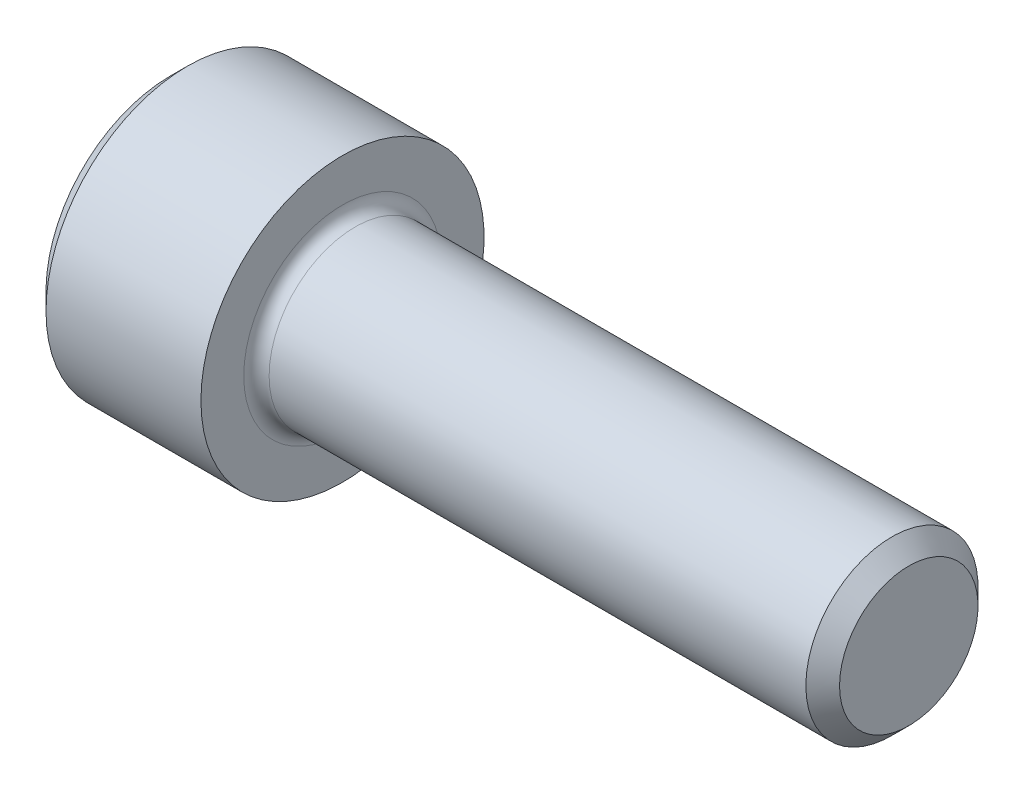
ISO-10303-21;
HEADER;
FILE_DESCRIPTION(('STEP AP214'),'2;1');
FILE_NAME('part.step','',(''),(''),'','','');
FILE_SCHEMA(('AUTOMOTIVE_DESIGN { 1 0 10303 214 1 1 1 1 }'));
ENDSEC;
DATA;
#1=APPLICATION_CONTEXT('core data for automotive mechanical design processes');
#2=APPLICATION_PROTOCOL_DEFINITION('international standard','automotive_design',2000,#1);
#3=PRODUCT_CONTEXT('',#1,'mechanical');
#4=PRODUCT('Part','Part','',(#3));
#5=PRODUCT_RELATED_PRODUCT_CATEGORY('part','',(#4));
#6=PRODUCT_DEFINITION_FORMATION('','',#4);
#7=PRODUCT_DEFINITION_CONTEXT('part definition',#1,'design');
#8=PRODUCT_DEFINITION('design','',#6,#7);
#9=PRODUCT_DEFINITION_SHAPE('','',#8);
#10=(LENGTH_UNIT() NAMED_UNIT(*) SI_UNIT(.MILLI.,.METRE.));
#11=(NAMED_UNIT(*) PLANE_ANGLE_UNIT() SI_UNIT($,.RADIAN.));
#12=(NAMED_UNIT(*) SI_UNIT($,.STERADIAN.) SOLID_ANGLE_UNIT());
#13=UNCERTAINTY_MEASURE_WITH_UNIT(LENGTH_MEASURE(1.E-05),#10,'distance_accuracy_value','');
#14=(GEOMETRIC_REPRESENTATION_CONTEXT(3) GLOBAL_UNCERTAINTY_ASSIGNED_CONTEXT((#13)) GLOBAL_UNIT_ASSIGNED_CONTEXT((#10,
#11,#12)) REPRESENTATION_CONTEXT('',''));
#15=CARTESIAN_POINT('',(0.,0.,0.));
#16=DIRECTION('',(0.,0.,1.));
#17=DIRECTION('',(1.,0.,0.));
#18=AXIS2_PLACEMENT_3D('',#15,#16,#17);
#19=CARTESIAN_POINT('',(2.286,1.14604605784411,1.98501));
#20=DIRECTION('',(-1.,0.,0.));
#21=DIRECTION('',(0.,0.,1.));
#22=AXIS2_PLACEMENT_3D('',#19,#20,#21);
#23=PLANE('',#22);
#24=DIRECTION('',(0.,0.500000000000001,0.866025403784438));
#25=VECTOR('',#24,1.);
#26=CARTESIAN_POINT('',(2.286,-1.71906908676614,0.992505));
#27=LINE('',#26,#25);
#28=CARTESIAN_POINT('',(2.2859999999804,-1.71906908679011,0.992505000013839));
#29=VERTEX_POINT('',#28);
#30=CARTESIAN_POINT('',(2.286,-1.14604605784409,1.98501));
#31=VERTEX_POINT('',#30);
#32=EDGE_CURVE('E100',#29,#31,#27,.T.);
#33=ORIENTED_EDGE('',*,*,#32,.T.);
#34=DIRECTION('',(0.,1.,0.));
#35=VECTOR('',#34,1.);
#36=CARTESIAN_POINT('',(2.286,1.14604605784411,1.98501));
#37=LINE('',#36,#35);
#38=CARTESIAN_POINT('',(2.28599999998701,0.,1.98501000001309));
#39=VERTEX_POINT('',#38);
#40=EDGE_CURVE('E95',#31,#39,#37,.T.);
#41=ORIENTED_EDGE('',*,*,#40,.T.);
#42=CARTESIAN_POINT('',(2.2859999999608,0.,0.));
#43=DIRECTION('',(-1.,0.,0.));
#44=DIRECTION('',(0.,0.,1.));
#45=AXIS2_PLACEMENT_3D('',#42,#43,#44);
#46=CIRCLE('',#45,1.98501000005535);
#47=EDGE_CURVE('E97',#39,#29,#46,.F.);
#48=ORIENTED_EDGE('',*,*,#47,.T.);
#49=EDGE_LOOP('',(#33,#41,#48));
#50=FACE_BOUND('',#49,.T.);
#51=ADVANCED_FACE('F16',(#50),#23,.T.);
#52=CARTESIAN_POINT('',(2.286,1.14604605784411,1.98501));
#53=DIRECTION('',(-1.,0.,0.));
#54=DIRECTION('',(0.,0.,1.));
#55=AXIS2_PLACEMENT_3D('',#52,#53,#54);
#56=PLANE('',#55);
#57=DIRECTION('',(0.,-0.499999999999998,0.86602540378444));
#58=VECTOR('',#57,1.);
#59=CARTESIAN_POINT('',(2.286,-1.71906908676615,-0.992504999999996));
#60=LINE('',#59,#58);
#61=CARTESIAN_POINT('',(2.2859999999804,-1.71906908679012,-0.992505000013836));
#62=VERTEX_POINT('',#61);
#63=CARTESIAN_POINT('',(2.286,-2.29209211568819,0.));
#64=VERTEX_POINT('',#63);
#65=EDGE_CURVE('E104',#62,#64,#60,.T.);
#66=ORIENTED_EDGE('',*,*,#65,.T.);
#67=DIRECTION('',(0.,0.500000000000001,0.866025403784438));
#68=VECTOR('',#67,1.);
#69=CARTESIAN_POINT('',(2.286,-2.29209211568819,0.));
#70=LINE('',#69,#68);
#71=EDGE_CURVE('E171',#64,#29,#70,.T.);
#72=ORIENTED_EDGE('',*,*,#71,.T.);
#73=CARTESIAN_POINT('',(2.2859999999608,0.,0.));
#74=DIRECTION('',(-1.,0.,0.));
#75=DIRECTION('',(0.,0.,1.));
#76=AXIS2_PLACEMENT_3D('',#73,#74,#75);
#77=CIRCLE('',#76,1.98501000005535);
#78=EDGE_CURVE('E116',#29,#62,#77,.F.);
#79=ORIENTED_EDGE('',*,*,#78,.T.);
#80=EDGE_LOOP('',(#66,#72,#79));
#81=FACE_BOUND('',#80,.T.);
#82=ADVANCED_FACE('F347',(#81),#56,.T.);
#83=CARTESIAN_POINT('',(2.286,1.14604605784411,1.98501));
#84=DIRECTION('',(-1.,0.,0.));
#85=DIRECTION('',(0.,0.,1.));
#86=AXIS2_PLACEMENT_3D('',#83,#84,#85);
#87=PLANE('',#86);
#88=DIRECTION('',(0.,1.,0.));
#89=VECTOR('',#88,1.);
#90=CARTESIAN_POINT('',(2.286,1.14604605784411,-1.98501));
#91=LINE('',#90,#89);
#92=CARTESIAN_POINT('',(2.28599999998701,0.,-1.98501000001309));
#93=VERTEX_POINT('',#92);
#94=CARTESIAN_POINT('',(2.286,-1.1460460578441,-1.98501));
#95=VERTEX_POINT('',#94);
#96=EDGE_CURVE('E166',#93,#95,#91,.F.);
#97=ORIENTED_EDGE('',*,*,#96,.T.);
#98=DIRECTION('',(0.,-0.499999999999999,0.866025403784439));
#99=VECTOR('',#98,1.);
#100=CARTESIAN_POINT('',(2.286,-1.1460460578441,-1.98501));
#101=LINE('',#100,#99);
#102=EDGE_CURVE('E161',#95,#62,#101,.T.);
#103=ORIENTED_EDGE('',*,*,#102,.T.);
#104=CARTESIAN_POINT('',(2.2859999999608,0.,0.));
#105=DIRECTION('',(-1.,0.,0.));
#106=DIRECTION('',(0.,0.,1.));
#107=AXIS2_PLACEMENT_3D('',#104,#105,#106);
#108=CIRCLE('',#107,1.98501000005535);
#109=EDGE_CURVE('E224',#62,#93,#108,.F.);
#110=ORIENTED_EDGE('',*,*,#109,.T.);
#111=EDGE_LOOP('',(#97,#103,#110));
#112=FACE_BOUND('',#111,.T.);
#113=ADVANCED_FACE('F344',(#112),#87,.T.);
#114=CARTESIAN_POINT('',(2.286,1.14604605784411,1.98501));
#115=DIRECTION('',(-1.,0.,0.));
#116=DIRECTION('',(0.,0.,1.));
#117=AXIS2_PLACEMENT_3D('',#114,#115,#116);
#118=PLANE('',#117);
#119=DIRECTION('',(0.,-0.500000000000001,-0.866025403784438));
#120=VECTOR('',#119,1.);
#121=CARTESIAN_POINT('',(2.286,1.71906908676615,-0.992505000000006));
#122=LINE('',#121,#120);
#123=CARTESIAN_POINT('',(2.2859999999804,1.71906908679012,-0.992505000013843));
#124=VERTEX_POINT('',#123);
#125=CARTESIAN_POINT('',(2.286,1.1460460578441,-1.98501));
#126=VERTEX_POINT('',#125);
#127=EDGE_CURVE('E156',#124,#126,#122,.T.);
#128=ORIENTED_EDGE('',*,*,#127,.T.);
#129=DIRECTION('',(0.,1.,0.));
#130=VECTOR('',#129,1.);
#131=CARTESIAN_POINT('',(2.286,1.14604605784411,-1.98501));
#132=LINE('',#131,#130);
#133=EDGE_CURVE('E151',#126,#93,#132,.F.);
#134=ORIENTED_EDGE('',*,*,#133,.T.);
#135=CARTESIAN_POINT('',(2.2859999999608,0.,0.));
#136=DIRECTION('',(-1.,0.,0.));
#137=DIRECTION('',(0.,0.,1.));
#138=AXIS2_PLACEMENT_3D('',#135,#136,#137);
#139=CIRCLE('',#138,1.98501000005535);
#140=EDGE_CURVE('E221',#93,#124,#139,.F.);
#141=ORIENTED_EDGE('',*,*,#140,.T.);
#142=EDGE_LOOP('',(#128,#134,#141));
#143=FACE_BOUND('',#142,.T.);
#144=ADVANCED_FACE('F340',(#143),#118,.T.);
#145=CARTESIAN_POINT('',(2.286,1.14604605784411,1.98501));
#146=DIRECTION('',(-1.,0.,0.));
#147=DIRECTION('',(0.,0.,1.));
#148=AXIS2_PLACEMENT_3D('',#145,#146,#147);
#149=PLANE('',#148);
#150=DIRECTION('',(0.,0.500000000000002,-0.866025403784437));
#151=VECTOR('',#150,1.);
#152=CARTESIAN_POINT('',(2.286,1.71906908676615,0.992504999999996));
#153=LINE('',#152,#151);
#154=CARTESIAN_POINT('',(2.2859999999804,1.71906908679012,0.992505000013835));
#155=VERTEX_POINT('',#154);
#156=CARTESIAN_POINT('',(2.286,2.2920921156882,0.));
#157=VERTEX_POINT('',#156);
#158=EDGE_CURVE('E146',#155,#157,#153,.T.);
#159=ORIENTED_EDGE('',*,*,#158,.T.);
#160=DIRECTION('',(0.,-0.500000000000002,-0.866025403784437));
#161=VECTOR('',#160,1.);
#162=CARTESIAN_POINT('',(2.286,2.2920921156882,0.));
#163=LINE('',#162,#161);
#164=EDGE_CURVE('E117',#157,#124,#163,.T.);
#165=ORIENTED_EDGE('',*,*,#164,.T.);
#166=CARTESIAN_POINT('',(2.2859999999608,0.,0.));
#167=DIRECTION('',(-1.,0.,0.));
#168=DIRECTION('',(0.,0.,1.));
#169=AXIS2_PLACEMENT_3D('',#166,#167,#168);
#170=CIRCLE('',#169,1.98501000005535);
#171=EDGE_CURVE('E124',#124,#155,#170,.F.);
#172=ORIENTED_EDGE('',*,*,#171,.T.);
#173=EDGE_LOOP('',(#159,#165,#172));
#174=FACE_BOUND('',#173,.T.);
#175=ADVANCED_FACE('F336',(#174),#149,.T.);
#176=CARTESIAN_POINT('',(2.28600000002643,0.,0.));
#177=DIRECTION('',(-1.,0.,0.));
#178=DIRECTION('',(0.,0.,1.));
#179=AXIS2_PLACEMENT_3D('',#176,#177,#178);
#180=CONICAL_SURFACE('',#179,1.98500999994167,1.04719755112655);
#181=CARTESIAN_POINT('',(3.43204605781011,0.,5.6843418860808E-11));
#182=VERTEX_POINT('',#181);
#183=VERTEX_LOOP('',#182);
#184=FACE_BOUND('',#183,.T.);
#185=ORIENTED_EDGE('',*,*,#47,.F.);
#186=CARTESIAN_POINT('',(2.2859999999608,0.,0.));
#187=DIRECTION('',(-1.,0.,0.));
#188=DIRECTION('',(0.,0.,1.));
#189=AXIS2_PLACEMENT_3D('',#186,#187,#188);
#190=CIRCLE('',#189,1.98501000005535);
#191=EDGE_CURVE('E112',#155,#39,#190,.F.);
#192=ORIENTED_EDGE('',*,*,#191,.F.);
#193=ORIENTED_EDGE('',*,*,#171,.F.);
#194=ORIENTED_EDGE('',*,*,#140,.F.);
#195=ORIENTED_EDGE('',*,*,#109,.F.);
#196=ORIENTED_EDGE('',*,*,#78,.F.);
#197=EDGE_LOOP('',(#185,#192,#193,#194,#195,#196));
#198=FACE_BOUND('',#197,.T.);
#199=ADVANCED_FACE('F110',(#184,#198),#180,.F.);
#200=CARTESIAN_POINT('',(2.286,1.14604605784411,1.98501));
#201=DIRECTION('',(-1.,0.,0.));
#202=DIRECTION('',(0.,0.,1.));
#203=AXIS2_PLACEMENT_3D('',#200,#201,#202);
#204=PLANE('',#203);
#205=DIRECTION('',(0.,-1.,0.));
#206=VECTOR('',#205,1.);
#207=CARTESIAN_POINT('',(2.286,-1.14604605784409,1.98501));
#208=LINE('',#207,#206);
#209=CARTESIAN_POINT('',(2.286,1.14604605784411,1.98501));
#210=VERTEX_POINT('',#209);
#211=EDGE_CURVE('E121',#39,#210,#208,.F.);
#212=ORIENTED_EDGE('',*,*,#211,.T.);
#213=DIRECTION('',(0.,0.499999999999998,-0.86602540378444));
#214=VECTOR('',#213,1.);
#215=CARTESIAN_POINT('',(2.286,2.2920921156882,0.));
#216=LINE('',#215,#214);
#217=EDGE_CURVE('E123',#155,#210,#216,.F.);
#218=ORIENTED_EDGE('',*,*,#217,.F.);
#219=ORIENTED_EDGE('',*,*,#191,.T.);
#220=EDGE_LOOP('',(#212,#218,#219));
#221=FACE_BOUND('',#220,.T.);
#222=ADVANCED_FACE('F120',(#221),#204,.T.);
#223=CARTESIAN_POINT('',(2.286,2.2920921156882,0.));
#224=DIRECTION('',(0.,-0.86602540378444,-0.499999999999998));
#225=DIRECTION('',(0.,0.499999999999998,-0.86602540378444));
#226=AXIS2_PLACEMENT_3D('',#223,#224,#225);
#227=PLANE('',#226);
#228=ORIENTED_EDGE('',*,*,#217,.T.);
#229=DIRECTION('',(1.,0.,0.));
#230=VECTOR('',#229,1.);
#231=CARTESIAN_POINT('',(2.286,1.14604605784411,1.98501));
#232=LINE('',#231,#230);
#233=CARTESIAN_POINT('',(0.,1.14604605784411,1.98501));
#234=VERTEX_POINT('',#233);
#235=EDGE_CURVE('E129',#210,#234,#232,.F.);
#236=ORIENTED_EDGE('',*,*,#235,.T.);
#237=DIRECTION('',(0.,-0.499999999999998,0.86602540378444));
#238=VECTOR('',#237,1.);
#239=CARTESIAN_POINT('',(0.,2.2920921156882,0.));
#240=LINE('',#239,#238);
#241=CARTESIAN_POINT('',(0.,2.2920921156882,0.));
#242=VERTEX_POINT('',#241);
#243=EDGE_CURVE('E136',#242,#234,#240,.T.);
#244=ORIENTED_EDGE('',*,*,#243,.F.);
#245=DIRECTION('',(1.,0.,0.));
#246=VECTOR('',#245,1.);
#247=CARTESIAN_POINT('',(2.286,2.2920921156882,0.));
#248=LINE('',#247,#246);
#249=EDGE_CURVE('E186',#242,#157,#248,.T.);
#250=ORIENTED_EDGE('',*,*,#249,.T.);
#251=ORIENTED_EDGE('',*,*,#158,.F.);
#252=EDGE_LOOP('',(#228,#236,#244,#250,#251));
#253=FACE_BOUND('',#252,.T.);
#254=ADVANCED_FACE('F328',(#253),#227,.T.);
#255=CARTESIAN_POINT('',(2.286,-1.14604605784409,1.98501));
#256=DIRECTION('',(0.,0.,1.));
#257=DIRECTION('',(0.,-1.,0.));
#258=AXIS2_PLACEMENT_3D('',#255,#256,#257);
#259=PLANE('',#258);
#260=ORIENTED_EDGE('',*,*,#235,.F.);
#261=ORIENTED_EDGE('',*,*,#211,.F.);
#262=ORIENTED_EDGE('',*,*,#40,.F.);
#263=DIRECTION('',(1.,0.,0.));
#264=VECTOR('',#263,1.);
#265=CARTESIAN_POINT('',(2.286,-1.14604605784409,1.98501));
#266=LINE('',#265,#264);
#267=CARTESIAN_POINT('',(0.,-1.14604605784409,1.98501));
#268=VERTEX_POINT('',#267);
#269=EDGE_CURVE('E131',#268,#31,#266,.T.);
#270=ORIENTED_EDGE('',*,*,#269,.F.);
#271=DIRECTION('',(0.,1.,0.));
#272=VECTOR('',#271,1.);
#273=CARTESIAN_POINT('',(0.,0.,1.98501));
#274=LINE('',#273,#272);
#275=EDGE_CURVE('E362',#234,#268,#274,.F.);
#276=ORIENTED_EDGE('',*,*,#275,.F.);
#277=EDGE_LOOP('',(#260,#261,#262,#270,#276));
#278=FACE_BOUND('',#277,.T.);
#279=ADVANCED_FACE('F127',(#278),#259,.F.);
#280=CARTESIAN_POINT('',(2.286,-1.14604605784409,1.98501));
#281=DIRECTION('',(0.,0.866025403784438,-0.500000000000001));
#282=DIRECTION('',(0.,0.500000000000001,0.866025403784438));
#283=AXIS2_PLACEMENT_3D('',#280,#281,#282);
#284=PLANE('',#283);
#285=ORIENTED_EDGE('',*,*,#71,.F.);
#286=DIRECTION('',(1.,0.,0.));
#287=VECTOR('',#286,1.);
#288=CARTESIAN_POINT('',(2.286,-2.29209211568819,0.));
#289=LINE('',#288,#287);
#290=CARTESIAN_POINT('',(0.,-2.29209211568819,0.));
#291=VERTEX_POINT('',#290);
#292=EDGE_CURVE('E197',#291,#64,#289,.T.);
#293=ORIENTED_EDGE('',*,*,#292,.F.);
#294=DIRECTION('',(0.,-0.500000000000001,-0.866025403784438));
#295=VECTOR('',#294,1.);
#296=CARTESIAN_POINT('',(0.,-1.14604605784409,1.98501));
#297=LINE('',#296,#295);
#298=EDGE_CURVE('E360',#268,#291,#297,.T.);
#299=ORIENTED_EDGE('',*,*,#298,.F.);
#300=ORIENTED_EDGE('',*,*,#269,.T.);
#301=ORIENTED_EDGE('',*,*,#32,.F.);
#302=EDGE_LOOP('',(#285,#293,#299,#300,#301));
#303=FACE_BOUND('',#302,.T.);
#304=ADVANCED_FACE('F321',(#303),#284,.T.);
#305=CARTESIAN_POINT('',(2.286,-2.29209211568819,0.));
#306=DIRECTION('',(0.,0.866025403784439,0.499999999999999));
#307=DIRECTION('',(0.,-0.499999999999999,0.866025403784439));
#308=AXIS2_PLACEMENT_3D('',#305,#306,#307);
#309=PLANE('',#308);
#310=ORIENTED_EDGE('',*,*,#102,.F.);
#311=DIRECTION('',(1.,0.,0.));
#312=VECTOR('',#311,1.);
#313=CARTESIAN_POINT('',(2.286,-1.1460460578441,-1.98501));
#314=LINE('',#313,#312);
#315=CARTESIAN_POINT('',(0.,-1.1460460578441,-1.98501));
#316=VERTEX_POINT('',#315);
#317=EDGE_CURVE('E190',#95,#316,#314,.F.);
#318=ORIENTED_EDGE('',*,*,#317,.T.);
#319=DIRECTION('',(0.,0.499999999999999,-0.86602540378444));
#320=VECTOR('',#319,1.);
#321=CARTESIAN_POINT('',(0.,-2.29209211568819,0.));
#322=LINE('',#321,#320);
#323=EDGE_CURVE('E357',#291,#316,#322,.T.);
#324=ORIENTED_EDGE('',*,*,#323,.F.);
#325=ORIENTED_EDGE('',*,*,#292,.T.);
#326=ORIENTED_EDGE('',*,*,#65,.F.);
#327=EDGE_LOOP('',(#310,#318,#324,#325,#326));
#328=FACE_BOUND('',#327,.T.);
#329=ADVANCED_FACE('F317',(#328),#309,.T.);
#330=CARTESIAN_POINT('',(2.286,1.1460460578441,-1.98501));
#331=DIRECTION('',(0.,0.,-1.));
#332=DIRECTION('',(0.,1.,0.));
#333=AXIS2_PLACEMENT_3D('',#330,#331,#332);
#334=PLANE('',#333);
#335=ORIENTED_EDGE('',*,*,#317,.F.);
#336=ORIENTED_EDGE('',*,*,#96,.F.);
#337=ORIENTED_EDGE('',*,*,#133,.F.);
#338=DIRECTION('',(1.,0.,0.));
#339=VECTOR('',#338,1.);
#340=CARTESIAN_POINT('',(2.286,1.1460460578441,-1.98501));
#341=LINE('',#340,#339);
#342=CARTESIAN_POINT('',(0.,1.1460460578441,-1.98501));
#343=VERTEX_POINT('',#342);
#344=EDGE_CURVE('E189',#126,#343,#341,.F.);
#345=ORIENTED_EDGE('',*,*,#344,.T.);
#346=DIRECTION('',(0.,1.,0.));
#347=VECTOR('',#346,1.);
#348=CARTESIAN_POINT('',(0.,0.,-1.98501));
#349=LINE('',#348,#347);
#350=EDGE_CURVE('E372',#316,#343,#349,.T.);
#351=ORIENTED_EDGE('',*,*,#350,.F.);
#352=EDGE_LOOP('',(#335,#336,#337,#345,#351));
#353=FACE_BOUND('',#352,.T.);
#354=ADVANCED_FACE('F313',(#353),#334,.F.);
#355=CARTESIAN_POINT('',(2.286,2.2920921156882,0.));
#356=DIRECTION('',(0.,0.866025403784438,-0.500000000000002));
#357=DIRECTION('',(0.,0.500000000000002,0.866025403784438));
#358=AXIS2_PLACEMENT_3D('',#355,#356,#357);
#359=PLANE('',#358);
#360=ORIENTED_EDGE('',*,*,#344,.F.);
#361=ORIENTED_EDGE('',*,*,#127,.F.);
#362=ORIENTED_EDGE('',*,*,#164,.F.);
#363=ORIENTED_EDGE('',*,*,#249,.F.);
#364=DIRECTION('',(0.,0.500000000000002,0.866025403784438));
#365=VECTOR('',#364,1.);
#366=CARTESIAN_POINT('',(0.,1.1460460578441,-1.98501));
#367=LINE('',#366,#365);
#368=EDGE_CURVE('E217',#343,#242,#367,.T.);
#369=ORIENTED_EDGE('',*,*,#368,.F.);
#370=EDGE_LOOP('',(#360,#361,#362,#363,#369));
#371=FACE_BOUND('',#370,.T.);
#372=ADVANCED_FACE('F309',(#371),#359,.F.);
#373=CARTESIAN_POINT('',(0.,0.,0.));
#374=DIRECTION('',(-1.,0.,0.));
#375=DIRECTION('',(0.,0.,1.));
#376=AXIS2_PLACEMENT_3D('',#373,#374,#375);
#377=PLANE('',#376);
#378=CARTESIAN_POINT('',(-5.6843418860808E-11,0.,0.));
#379=DIRECTION('',(1.,0.,0.));
#380=DIRECTION('',(0.,1.,0.));
#381=AXIS2_PLACEMENT_3D('',#378,#379,#380);
#382=CIRCLE('',#381,3.48615000001473);
#383=CARTESIAN_POINT('',(-5.68434426698877E-11,3.48615000001473,0.));
#384=VERTEX_POINT('',#383);
#385=EDGE_CURVE('E215',#384,#384,#382,.T.);
#386=ORIENTED_EDGE('',*,*,#385,.F.);
#387=EDGE_LOOP('',(#386));
#388=FACE_BOUND('',#387,.T.);
#389=ORIENTED_EDGE('',*,*,#350,.T.);
#390=ORIENTED_EDGE('',*,*,#368,.T.);
#391=ORIENTED_EDGE('',*,*,#243,.T.);
#392=ORIENTED_EDGE('',*,*,#275,.T.);
#393=ORIENTED_EDGE('',*,*,#298,.T.);
#394=ORIENTED_EDGE('',*,*,#323,.T.);
#395=EDGE_LOOP('',(#389,#390,#391,#392,#393,#394));
#396=FACE_BOUND('',#395,.T.);
#397=ADVANCED_FACE('F301',(#388,#396),#377,.T.);
#398=CARTESIAN_POINT('',(0.482599999998001,0.,0.));
#399=DIRECTION('',(1.,0.,0.));
#400=DIRECTION('',(0.,1.,0.));
#401=AXIS2_PLACEMENT_3D('',#398,#399,#400);
#402=CONICAL_SURFACE('',#401,3.96875000006958,0.785398163397448);
#403=ORIENTED_EDGE('',*,*,#385,.T.);
#404=EDGE_LOOP('',(#403));
#405=FACE_BOUND('',#404,.T.);
#406=CARTESIAN_POINT('',(0.4826,0.,0.));
#407=DIRECTION('',(-1.,0.,0.));
#408=DIRECTION('',(0.,0.,1.));
#409=AXIS2_PLACEMENT_3D('',#406,#407,#408);
#410=CIRCLE('',#409,3.96875);
#411=CARTESIAN_POINT('',(0.4826,0.,3.96875));
#412=VERTEX_POINT('',#411);
#413=EDGE_CURVE('E214',#412,#412,#410,.F.);
#414=ORIENTED_EDGE('',*,*,#413,.F.);
#415=EDGE_LOOP('',(#414));
#416=FACE_BOUND('',#415,.T.);
#417=ADVANCED_FACE('F296',(#405,#416),#402,.T.);
#418=CARTESIAN_POINT('',(-31.75,0.,0.));
#419=DIRECTION('',(-1.,0.,0.));
#420=DIRECTION('',(0.,0.,1.));
#421=AXIS2_PLACEMENT_3D('',#418,#419,#420);
#422=CYLINDRICAL_SURFACE('',#421,3.96875);
#423=CARTESIAN_POINT('',(4.826,0.,0.));
#424=DIRECTION('',(-1.,0.,0.));
#425=DIRECTION('',(0.,0.,1.));
#426=AXIS2_PLACEMENT_3D('',#423,#424,#425);
#427=CIRCLE('',#426,3.96875);
#428=CARTESIAN_POINT('',(4.826,0.,3.96875));
#429=VERTEX_POINT('',#428);
#430=EDGE_CURVE('E211',#429,#429,#427,.F.);
#431=ORIENTED_EDGE('',*,*,#430,.F.);
#432=EDGE_LOOP('',(#431));
#433=FACE_BOUND('',#432,.T.);
#434=ORIENTED_EDGE('',*,*,#413,.T.);
#435=EDGE_LOOP('',(#434));
#436=FACE_BOUND('',#435,.T.);
#437=ADVANCED_FACE('F292',(#433,#436),#422,.T.);
#438=CARTESIAN_POINT('',(20.701,1.94056,0.));
#439=DIRECTION('',(1.,0.,0.));
#440=DIRECTION('',(0.,0.,-1.));
#441=AXIS2_PLACEMENT_3D('',#438,#439,#440);
#442=PLANE('',#441);
#443=CARTESIAN_POINT('',(20.7009999999741,0.,0.));
#444=DIRECTION('',(-1.,0.,0.));
#445=DIRECTION('',(0.,0.,1.));
#446=AXIS2_PLACEMENT_3D('',#443,#444,#445);
#447=CIRCLE('',#446,1.94056000003684);
#448=CARTESIAN_POINT('',(20.7009999999741,0.,1.94056000003684));
#449=VERTEX_POINT('',#448);
#450=EDGE_CURVE('E207',#449,#449,#447,.T.);
#451=ORIENTED_EDGE('',*,*,#450,.F.);
#452=EDGE_LOOP('',(#451));
#453=FACE_BOUND('',#452,.T.);
#454=ADVANCED_FACE('F250',(#453),#442,.T.);
#455=CARTESIAN_POINT('',(4.826,3.96875,0.));
#456=DIRECTION('',(1.,0.,0.));
#457=DIRECTION('',(0.,0.,-1.));
#458=AXIS2_PLACEMENT_3D('',#455,#456,#457);
#459=PLANE('',#458);
#460=ORIENTED_EDGE('',*,*,#430,.T.);
#461=EDGE_LOOP('',(#460));
#462=FACE_BOUND('',#461,.T.);
#463=CARTESIAN_POINT('',(4.826,0.,0.));
#464=DIRECTION('',(1.,0.,0.));
#465=DIRECTION('',(0.,0.,1.));
#466=AXIS2_PLACEMENT_3D('',#463,#464,#465);
#467=CIRCLE('',#466,2.76859999999999);
#468=CARTESIAN_POINT('',(4.826,0.,-2.76859999999999));
#469=VERTEX_POINT('',#468);
#470=CARTESIAN_POINT('',(4.826,0.,2.76859999999999));
#471=VERTEX_POINT('',#470);
#472=EDGE_CURVE('E210',#469,#471,#467,.F.);
#473=ORIENTED_EDGE('',*,*,#472,.T.);
#474=CARTESIAN_POINT('',(4.826,0.,0.));
#475=DIRECTION('',(1.,0.,0.));
#476=DIRECTION('',(0.,0.,-1.));
#477=AXIS2_PLACEMENT_3D('',#474,#475,#476);
#478=CIRCLE('',#477,2.76859999999999);
#479=EDGE_CURVE('E35',#471,#469,#478,.F.);
#480=ORIENTED_EDGE('',*,*,#479,.T.);
#481=EDGE_LOOP('',(#473,#480));
#482=FACE_BOUND('',#481,.T.);
#483=ADVANCED_FACE('F231',(#462,#482),#459,.T.);
#484=CARTESIAN_POINT('',(20.2285600000778,0.,0.));
#485=DIRECTION('',(-1.,0.,0.));
#486=DIRECTION('',(0.,0.,1.));
#487=AXIS2_PLACEMENT_3D('',#484,#485,#486);
#488=CONICAL_SURFACE('',#487,2.41299999987632,0.785398163337289);
#489=CARTESIAN_POINT('',(20.22856,0.,0.));
#490=DIRECTION('',(-1.,0.,0.));
#491=DIRECTION('',(0.,0.,1.));
#492=AXIS2_PLACEMENT_3D('',#489,#490,#491);
#493=CIRCLE('',#492,2.41299999999999);
#494=CARTESIAN_POINT('',(20.22856,0.,2.41299999999999));
#495=VERTEX_POINT('',#494);
#496=EDGE_CURVE('E27',#495,#495,#493,.T.);
#497=ORIENTED_EDGE('',*,*,#496,.F.);
#498=EDGE_LOOP('',(#497));
#499=FACE_BOUND('',#498,.T.);
#500=ORIENTED_EDGE('',*,*,#450,.T.);
#501=EDGE_LOOP('',(#500));
#502=FACE_BOUND('',#501,.T.);
#503=ADVANCED_FACE('F249',(#499,#502),#488,.T.);
#504=CARTESIAN_POINT('',(5.1816,0.,0.));
#505=DIRECTION('',(1.,0.,0.));
#506=DIRECTION('',(0.,0.,-1.));
#507=AXIS2_PLACEMENT_3D('',#504,#505,#506);
#508=TOROIDAL_SURFACE('',#507,2.76859999999999,0.3556);
#509=CARTESIAN_POINT('',(5.1816,0.,0.));
#510=DIRECTION('',(-1.,0.,0.));
#511=DIRECTION('',(0.,0.,1.));
#512=AXIS2_PLACEMENT_3D('',#509,#510,#511);
#513=CIRCLE('',#512,2.41299999999999);
#514=CARTESIAN_POINT('',(5.1816,0.,2.41299999999999));
#515=VERTEX_POINT('',#514);
#516=EDGE_CURVE('E11',#515,#515,#513,.F.);
#517=ORIENTED_EDGE('',*,*,#516,.F.);
#518=EDGE_LOOP('',(#517));
#519=FACE_BOUND('',#518,.T.);
#520=ORIENTED_EDGE('',*,*,#472,.F.);
#521=ORIENTED_EDGE('',*,*,#479,.F.);
#522=EDGE_LOOP('',(#520,#521));
#523=FACE_BOUND('',#522,.T.);
#524=ADVANCED_FACE('F228',(#519,#523),#508,.F.);
#525=CARTESIAN_POINT('',(-31.75,0.,0.));
#526=DIRECTION('',(-1.,0.,0.));
#527=DIRECTION('',(0.,0.,1.));
#528=AXIS2_PLACEMENT_3D('',#525,#526,#527);
#529=CYLINDRICAL_SURFACE('',#528,2.41299999999999);
#530=ORIENTED_EDGE('',*,*,#516,.T.);
#531=EDGE_LOOP('',(#530));
#532=FACE_BOUND('',#531,.T.);
#533=ORIENTED_EDGE('',*,*,#496,.T.);
#534=EDGE_LOOP('',(#533));
#535=FACE_BOUND('',#534,.T.);
#536=ADVANCED_FACE('F274',(#532,#535),#529,.T.);
#537=CLOSED_SHELL('',(#51,#82,#113,#144,#175,#199,#222,#254,#279,#304,#329,#354,#372,#397,#417,
#437,#454,#483,#503,#524,#536));
#538=MANIFOLD_SOLID_BREP('B1',#537);
#539=ADVANCED_BREP_SHAPE_REPRESENTATION('',(#18,#538),#14);
#540=SHAPE_DEFINITION_REPRESENTATION(#9,#539);
ENDSEC;
END-ISO-10303-21;
